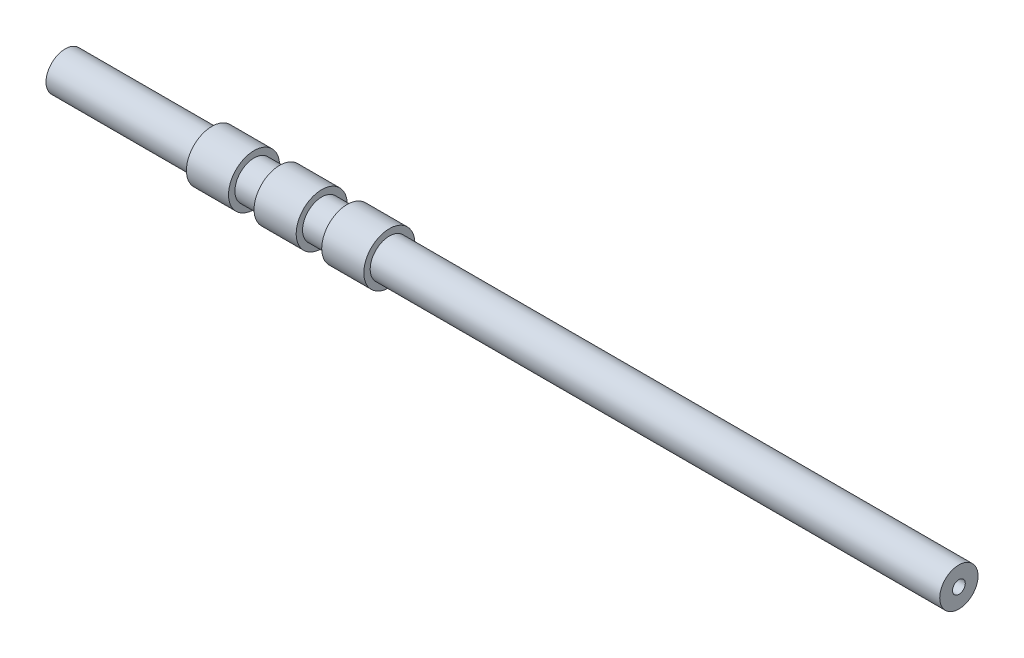
ISO-10303-21;
HEADER;
FILE_DESCRIPTION(('STEP AP214'),'2;1');
FILE_NAME('part.step','',(''),(''),'','','');
FILE_SCHEMA(('AUTOMOTIVE_DESIGN { 1 0 10303 214 1 1 1 1 }'));
ENDSEC;
DATA;
#1=APPLICATION_CONTEXT('core data for automotive mechanical design processes');
#2=APPLICATION_PROTOCOL_DEFINITION('international standard','automotive_design',2000,#1);
#3=PRODUCT_CONTEXT('',#1,'mechanical');
#4=PRODUCT('Part','Part','',(#3));
#5=PRODUCT_RELATED_PRODUCT_CATEGORY('part','',(#4));
#6=PRODUCT_DEFINITION_FORMATION('','',#4);
#7=PRODUCT_DEFINITION_CONTEXT('part definition',#1,'design');
#8=PRODUCT_DEFINITION('design','',#6,#7);
#9=PRODUCT_DEFINITION_SHAPE('','',#8);
#10=(LENGTH_UNIT() NAMED_UNIT(*) SI_UNIT(.MILLI.,.METRE.));
#11=(NAMED_UNIT(*) PLANE_ANGLE_UNIT() SI_UNIT($,.RADIAN.));
#12=(NAMED_UNIT(*) SI_UNIT($,.STERADIAN.) SOLID_ANGLE_UNIT());
#13=UNCERTAINTY_MEASURE_WITH_UNIT(LENGTH_MEASURE(1.E-05),#10,'distance_accuracy_value','');
#14=(GEOMETRIC_REPRESENTATION_CONTEXT(3) GLOBAL_UNCERTAINTY_ASSIGNED_CONTEXT((#13)) GLOBAL_UNIT_ASSIGNED_CONTEXT((#10,
#11,#12)) REPRESENTATION_CONTEXT('',''));
#15=CARTESIAN_POINT('',(0.,0.,0.));
#16=DIRECTION('',(0.,0.,1.));
#17=DIRECTION('',(1.,0.,0.));
#18=AXIS2_PLACEMENT_3D('',#15,#16,#17);
#19=CARTESIAN_POINT('',(-114.603174603175,0.,0.));
#20=DIRECTION('',(-1.,0.,0.));
#21=DIRECTION('',(0.,0.,1.));
#22=AXIS2_PLACEMENT_3D('',#19,#20,#21);
#23=CYLINDRICAL_SURFACE('',#22,5.);
#24=CARTESIAN_POINT('',(522.301587301587,0.,0.));
#25=DIRECTION('',(-1.,0.,0.));
#26=DIRECTION('',(0.,0.,1.));
#27=AXIS2_PLACEMENT_3D('',#24,#25,#26);
#28=CIRCLE('',#27,5.);
#29=CARTESIAN_POINT('',(522.301587301587,0.,5.));
#30=VERTEX_POINT('',#29);
#31=EDGE_CURVE('E123',#30,#30,#28,.T.);
#32=ORIENTED_EDGE('',*,*,#31,.F.);
#33=EDGE_LOOP('',(#32));
#34=FACE_BOUND('',#33,.T.);
#35=CARTESIAN_POINT('',(66.2115873015873,0.,0.));
#36=DIRECTION('',(-1.,0.,0.));
#37=DIRECTION('',(0.,0.,1.));
#38=AXIS2_PLACEMENT_3D('',#35,#36,#37);
#39=CIRCLE('',#38,5.);
#40=CARTESIAN_POINT('',(66.2115873015873,0.,5.));
#41=VERTEX_POINT('',#40);
#42=EDGE_CURVE('E10',#41,#41,#39,.T.);
#43=ORIENTED_EDGE('',*,*,#42,.T.);
#44=EDGE_LOOP('',(#43));
#45=FACE_BOUND('',#44,.T.);
#46=ADVANCED_FACE('F35',(#34,#45),#23,.F.);
#47=CARTESIAN_POINT('',(66.2115873015873,20.,0.));
#48=DIRECTION('',(1.,0.,0.));
#49=DIRECTION('',(0.,0.,-1.));
#50=AXIS2_PLACEMENT_3D('',#47,#48,#49);
#51=PLANE('',#50);
#52=ORIENTED_EDGE('',*,*,#42,.F.);
#53=EDGE_LOOP('',(#52));
#54=FACE_BOUND('',#53,.T.);
#55=CARTESIAN_POINT('',(66.2115873015873,0.,0.));
#56=DIRECTION('',(-1.,0.,0.));
#57=DIRECTION('',(0.,0.,1.));
#58=AXIS2_PLACEMENT_3D('',#55,#56,#57);
#59=CIRCLE('',#58,10.);
#60=CARTESIAN_POINT('',(66.2115873015873,0.,10.));
#61=VERTEX_POINT('',#60);
#62=EDGE_CURVE('E41',#61,#61,#59,.T.);
#63=ORIENTED_EDGE('',*,*,#62,.T.);
#64=EDGE_LOOP('',(#63));
#65=FACE_BOUND('',#64,.T.);
#66=ADVANCED_FACE('F131',(#54,#65),#51,.F.);
#67=CARTESIAN_POINT('',(-114.603174603175,0.,0.));
#68=DIRECTION('',(-1.,0.,0.));
#69=DIRECTION('',(0.,0.,1.));
#70=AXIS2_PLACEMENT_3D('',#67,#68,#69);
#71=CYLINDRICAL_SURFACE('',#70,10.);
#72=ORIENTED_EDGE('',*,*,#62,.F.);
#73=EDGE_LOOP('',(#72));
#74=FACE_BOUND('',#73,.T.);
#75=CARTESIAN_POINT('',(53.2415873015873,0.,0.));
#76=DIRECTION('',(-1.,0.,0.));
#77=DIRECTION('',(0.,0.,1.));
#78=AXIS2_PLACEMENT_3D('',#75,#76,#77);
#79=CIRCLE('',#78,10.);
#80=CARTESIAN_POINT('',(53.2415873015873,0.,10.));
#81=VERTEX_POINT('',#80);
#82=EDGE_CURVE('E45',#81,#81,#79,.T.);
#83=ORIENTED_EDGE('',*,*,#82,.T.);
#84=EDGE_LOOP('',(#83));
#85=FACE_BOUND('',#84,.T.);
#86=ADVANCED_FACE('F135',(#74,#85),#71,.F.);
#87=CARTESIAN_POINT('',(53.2415873015873,15.,0.));
#88=DIRECTION('',(-1.,0.,0.));
#89=DIRECTION('',(0.,0.,1.));
#90=AXIS2_PLACEMENT_3D('',#87,#88,#89);
#91=PLANE('',#90);
#92=ORIENTED_EDGE('',*,*,#82,.F.);
#93=EDGE_LOOP('',(#92));
#94=FACE_BOUND('',#93,.T.);
#95=CARTESIAN_POINT('',(53.2415873015873,0.,0.));
#96=DIRECTION('',(-1.,0.,0.));
#97=DIRECTION('',(0.,0.,1.));
#98=AXIS2_PLACEMENT_3D('',#95,#96,#97);
#99=CIRCLE('',#98,5.);
#100=CARTESIAN_POINT('',(53.2415873015873,0.,5.));
#101=VERTEX_POINT('',#100);
#102=EDGE_CURVE('E49',#101,#101,#99,.T.);
#103=ORIENTED_EDGE('',*,*,#102,.T.);
#104=EDGE_LOOP('',(#103));
#105=FACE_BOUND('',#104,.T.);
#106=ADVANCED_FACE('F140',(#94,#105),#91,.F.);
#107=CARTESIAN_POINT('',(-114.603174603175,0.,0.));
#108=DIRECTION('',(-1.,0.,0.));
#109=DIRECTION('',(0.,0.,1.));
#110=AXIS2_PLACEMENT_3D('',#107,#108,#109);
#111=CYLINDRICAL_SURFACE('',#110,5.);
#112=ORIENTED_EDGE('',*,*,#102,.F.);
#113=EDGE_LOOP('',(#112));
#114=FACE_BOUND('',#113,.T.);
#115=CARTESIAN_POINT('',(13.2415873015873,0.,0.));
#116=DIRECTION('',(-1.,0.,0.));
#117=DIRECTION('',(0.,0.,1.));
#118=AXIS2_PLACEMENT_3D('',#115,#116,#117);
#119=CIRCLE('',#118,5.);
#120=CARTESIAN_POINT('',(13.2415873015873,0.,5.));
#121=VERTEX_POINT('',#120);
#122=EDGE_CURVE('E54',#121,#121,#119,.T.);
#123=ORIENTED_EDGE('',*,*,#122,.T.);
#124=EDGE_LOOP('',(#123));
#125=FACE_BOUND('',#124,.T.);
#126=ADVANCED_FACE('F146',(#114,#125),#111,.F.);
#127=CARTESIAN_POINT('',(13.2415873015873,20.,0.));
#128=DIRECTION('',(1.,0.,0.));
#129=DIRECTION('',(0.,0.,-1.));
#130=AXIS2_PLACEMENT_3D('',#127,#128,#129);
#131=PLANE('',#130);
#132=ORIENTED_EDGE('',*,*,#122,.F.);
#133=EDGE_LOOP('',(#132));
#134=FACE_BOUND('',#133,.T.);
#135=CARTESIAN_POINT('',(13.2415873015873,0.,0.));
#136=DIRECTION('',(-1.,0.,0.));
#137=DIRECTION('',(0.,0.,1.));
#138=AXIS2_PLACEMENT_3D('',#135,#136,#137);
#139=CIRCLE('',#138,10.);
#140=CARTESIAN_POINT('',(13.2415873015873,0.,10.));
#141=VERTEX_POINT('',#140);
#142=EDGE_CURVE('E57',#141,#141,#139,.T.);
#143=ORIENTED_EDGE('',*,*,#142,.T.);
#144=EDGE_LOOP('',(#143));
#145=FACE_BOUND('',#144,.T.);
#146=ADVANCED_FACE('F150',(#134,#145),#131,.F.);
#147=CARTESIAN_POINT('',(-114.603174603175,0.,0.));
#148=DIRECTION('',(-1.,0.,0.));
#149=DIRECTION('',(0.,0.,1.));
#150=AXIS2_PLACEMENT_3D('',#147,#148,#149);
#151=CYLINDRICAL_SURFACE('',#150,10.);
#152=ORIENTED_EDGE('',*,*,#142,.F.);
#153=EDGE_LOOP('',(#152));
#154=FACE_BOUND('',#153,.T.);
#155=CARTESIAN_POINT('',(0.271587301587287,0.,0.));
#156=DIRECTION('',(-1.,0.,0.));
#157=DIRECTION('',(0.,0.,1.));
#158=AXIS2_PLACEMENT_3D('',#155,#156,#157);
#159=CIRCLE('',#158,10.);
#160=CARTESIAN_POINT('',(0.271587301587287,0.,10.));
#161=VERTEX_POINT('',#160);
#162=EDGE_CURVE('E60',#161,#161,#159,.T.);
#163=ORIENTED_EDGE('',*,*,#162,.T.);
#164=EDGE_LOOP('',(#163));
#165=FACE_BOUND('',#164,.T.);
#166=ADVANCED_FACE('F154',(#154,#165),#151,.F.);
#167=CARTESIAN_POINT('',(0.271587301587288,15.,0.));
#168=DIRECTION('',(-1.,0.,0.));
#169=DIRECTION('',(0.,0.,1.));
#170=AXIS2_PLACEMENT_3D('',#167,#168,#169);
#171=PLANE('',#170);
#172=ORIENTED_EDGE('',*,*,#162,.F.);
#173=EDGE_LOOP('',(#172));
#174=FACE_BOUND('',#173,.T.);
#175=CARTESIAN_POINT('',(0.271587301587287,0.,0.));
#176=DIRECTION('',(-1.,0.,0.));
#177=DIRECTION('',(0.,0.,1.));
#178=AXIS2_PLACEMENT_3D('',#175,#176,#177);
#179=CIRCLE('',#178,5.);
#180=CARTESIAN_POINT('',(0.271587301587287,0.,5.));
#181=VERTEX_POINT('',#180);
#182=EDGE_CURVE('E63',#181,#181,#179,.T.);
#183=ORIENTED_EDGE('',*,*,#182,.T.);
#184=EDGE_LOOP('',(#183));
#185=FACE_BOUND('',#184,.T.);
#186=ADVANCED_FACE('F158',(#174,#185),#171,.F.);
#187=CARTESIAN_POINT('',(-114.603174603175,0.,0.));
#188=DIRECTION('',(-1.,0.,0.));
#189=DIRECTION('',(0.,0.,1.));
#190=AXIS2_PLACEMENT_3D('',#187,#188,#189);
#191=CYLINDRICAL_SURFACE('',#190,5.);
#192=ORIENTED_EDGE('',*,*,#182,.F.);
#193=EDGE_LOOP('',(#192));
#194=FACE_BOUND('',#193,.T.);
#195=CARTESIAN_POINT('',(-39.7284126984127,0.,0.));
#196=DIRECTION('',(-1.,0.,0.));
#197=DIRECTION('',(0.,0.,1.));
#198=AXIS2_PLACEMENT_3D('',#195,#196,#197);
#199=CIRCLE('',#198,5.);
#200=CARTESIAN_POINT('',(-39.7284126984127,0.,5.));
#201=VERTEX_POINT('',#200);
#202=EDGE_CURVE('E66',#201,#201,#199,.T.);
#203=ORIENTED_EDGE('',*,*,#202,.T.);
#204=EDGE_LOOP('',(#203));
#205=FACE_BOUND('',#204,.T.);
#206=ADVANCED_FACE('F162',(#194,#205),#191,.F.);
#207=CARTESIAN_POINT('',(-39.7284126984127,20.,0.));
#208=DIRECTION('',(1.,0.,0.));
#209=DIRECTION('',(0.,0.,-1.));
#210=AXIS2_PLACEMENT_3D('',#207,#208,#209);
#211=PLANE('',#210);
#212=ORIENTED_EDGE('',*,*,#202,.F.);
#213=EDGE_LOOP('',(#212));
#214=FACE_BOUND('',#213,.T.);
#215=CARTESIAN_POINT('',(-39.7284126984127,0.,0.));
#216=DIRECTION('',(-1.,0.,0.));
#217=DIRECTION('',(0.,0.,1.));
#218=AXIS2_PLACEMENT_3D('',#215,#216,#217);
#219=CIRCLE('',#218,10.);
#220=CARTESIAN_POINT('',(-39.7284126984127,0.,10.));
#221=VERTEX_POINT('',#220);
#222=EDGE_CURVE('E69',#221,#221,#219,.T.);
#223=ORIENTED_EDGE('',*,*,#222,.T.);
#224=EDGE_LOOP('',(#223));
#225=FACE_BOUND('',#224,.T.);
#226=ADVANCED_FACE('F166',(#214,#225),#211,.F.);
#227=CARTESIAN_POINT('',(-114.603174603175,0.,0.));
#228=DIRECTION('',(-1.,0.,0.));
#229=DIRECTION('',(0.,0.,1.));
#230=AXIS2_PLACEMENT_3D('',#227,#228,#229);
#231=CYLINDRICAL_SURFACE('',#230,10.);
#232=ORIENTED_EDGE('',*,*,#222,.F.);
#233=EDGE_LOOP('',(#232));
#234=FACE_BOUND('',#233,.T.);
#235=CARTESIAN_POINT('',(-52.6984126984127,0.,0.));
#236=DIRECTION('',(-1.,0.,0.));
#237=DIRECTION('',(0.,0.,1.));
#238=AXIS2_PLACEMENT_3D('',#235,#236,#237);
#239=CIRCLE('',#238,10.);
#240=CARTESIAN_POINT('',(-52.6984126984127,0.,10.));
#241=VERTEX_POINT('',#240);
#242=EDGE_CURVE('E72',#241,#241,#239,.T.);
#243=ORIENTED_EDGE('',*,*,#242,.T.);
#244=EDGE_LOOP('',(#243));
#245=FACE_BOUND('',#244,.T.);
#246=ADVANCED_FACE('F170',(#234,#245),#231,.F.);
#247=CARTESIAN_POINT('',(-52.6984126984127,15.,0.));
#248=DIRECTION('',(-1.,0.,0.));
#249=DIRECTION('',(0.,0.,1.));
#250=AXIS2_PLACEMENT_3D('',#247,#248,#249);
#251=PLANE('',#250);
#252=ORIENTED_EDGE('',*,*,#242,.F.);
#253=EDGE_LOOP('',(#252));
#254=FACE_BOUND('',#253,.T.);
#255=CARTESIAN_POINT('',(-52.6984126984127,0.,0.));
#256=DIRECTION('',(-1.,0.,0.));
#257=DIRECTION('',(0.,0.,1.));
#258=AXIS2_PLACEMENT_3D('',#255,#256,#257);
#259=CIRCLE('',#258,5.);
#260=CARTESIAN_POINT('',(-52.6984126984127,0.,5.));
#261=VERTEX_POINT('',#260);
#262=EDGE_CURVE('E75',#261,#261,#259,.T.);
#263=ORIENTED_EDGE('',*,*,#262,.T.);
#264=EDGE_LOOP('',(#263));
#265=FACE_BOUND('',#264,.T.);
#266=ADVANCED_FACE('F174',(#254,#265),#251,.F.);
#267=CARTESIAN_POINT('',(-114.603174603175,0.,0.));
#268=DIRECTION('',(-1.,0.,0.));
#269=DIRECTION('',(0.,0.,1.));
#270=AXIS2_PLACEMENT_3D('',#267,#268,#269);
#271=CYLINDRICAL_SURFACE('',#270,4.99999999999999);
#272=ORIENTED_EDGE('',*,*,#262,.F.);
#273=EDGE_LOOP('',(#272));
#274=FACE_BOUND('',#273,.T.);
#275=CARTESIAN_POINT('',(-177.698412698413,0.,0.));
#276=DIRECTION('',(-1.,0.,0.));
#277=DIRECTION('',(0.,0.,1.));
#278=AXIS2_PLACEMENT_3D('',#275,#276,#277);
#279=CIRCLE('',#278,4.99999999999999);
#280=CARTESIAN_POINT('',(-177.698412698413,0.,4.99999999999999));
#281=VERTEX_POINT('',#280);
#282=EDGE_CURVE('E78',#281,#281,#279,.T.);
#283=ORIENTED_EDGE('',*,*,#282,.T.);
#284=EDGE_LOOP('',(#283));
#285=FACE_BOUND('',#284,.T.);
#286=ADVANCED_FACE('F178',(#274,#285),#271,.F.);
#287=CARTESIAN_POINT('',(-177.698412698413,4.99999999999999,0.));
#288=DIRECTION('',(-1.,0.,0.));
#289=DIRECTION('',(0.,0.,1.));
#290=AXIS2_PLACEMENT_3D('',#287,#288,#289);
#291=PLANE('',#290);
#292=CARTESIAN_POINT('',(-177.698412698413,0.,0.));
#293=DIRECTION('',(-1.,0.,0.));
#294=DIRECTION('',(0.,0.,1.));
#295=AXIS2_PLACEMENT_3D('',#292,#293,#294);
#296=CIRCLE('',#295,15.);
#297=CARTESIAN_POINT('',(-177.698412698413,0.,15.));
#298=VERTEX_POINT('',#297);
#299=EDGE_CURVE('E81',#298,#298,#296,.T.);
#300=ORIENTED_EDGE('',*,*,#299,.T.);
#301=EDGE_LOOP('',(#300));
#302=FACE_BOUND('',#301,.T.);
#303=ORIENTED_EDGE('',*,*,#282,.F.);
#304=EDGE_LOOP('',(#303));
#305=FACE_BOUND('',#304,.T.);
#306=ADVANCED_FACE('F182',(#302,#305),#291,.T.);
#307=CARTESIAN_POINT('',(-114.603174603175,0.,0.));
#308=DIRECTION('',(-1.,0.,0.));
#309=DIRECTION('',(0.,0.,1.));
#310=AXIS2_PLACEMENT_3D('',#307,#308,#309);
#311=CYLINDRICAL_SURFACE('',#310,15.);
#312=CARTESIAN_POINT('',(-62.6984126984127,0.,0.));
#313=DIRECTION('',(-1.,0.,0.));
#314=DIRECTION('',(0.,0.,1.));
#315=AXIS2_PLACEMENT_3D('',#312,#313,#314);
#316=CIRCLE('',#315,15.);
#317=CARTESIAN_POINT('',(-62.6984126984127,0.,15.));
#318=VERTEX_POINT('',#317);
#319=EDGE_CURVE('E84',#318,#318,#316,.T.);
#320=ORIENTED_EDGE('',*,*,#319,.T.);
#321=EDGE_LOOP('',(#320));
#322=FACE_BOUND('',#321,.T.);
#323=ORIENTED_EDGE('',*,*,#299,.F.);
#324=EDGE_LOOP('',(#323));
#325=FACE_BOUND('',#324,.T.);
#326=ADVANCED_FACE('F186',(#322,#325),#311,.T.);
#327=CARTESIAN_POINT('',(-62.6984126984127,15.,0.));
#328=DIRECTION('',(-1.,0.,0.));
#329=DIRECTION('',(0.,0.,1.));
#330=AXIS2_PLACEMENT_3D('',#327,#328,#329);
#331=PLANE('',#330);
#332=CARTESIAN_POINT('',(-62.6984126984127,0.,0.));
#333=DIRECTION('',(-1.,0.,0.));
#334=DIRECTION('',(0.,0.,1.));
#335=AXIS2_PLACEMENT_3D('',#332,#333,#334);
#336=CIRCLE('',#335,20.);
#337=CARTESIAN_POINT('',(-62.6984126984127,0.,20.));
#338=VERTEX_POINT('',#337);
#339=EDGE_CURVE('E87',#338,#338,#336,.T.);
#340=ORIENTED_EDGE('',*,*,#339,.T.);
#341=EDGE_LOOP('',(#340));
#342=FACE_BOUND('',#341,.T.);
#343=ORIENTED_EDGE('',*,*,#319,.F.);
#344=EDGE_LOOP('',(#343));
#345=FACE_BOUND('',#344,.T.);
#346=ADVANCED_FACE('F190',(#342,#345),#331,.T.);
#347=CARTESIAN_POINT('',(-114.603174603175,0.,0.));
#348=DIRECTION('',(-1.,0.,0.));
#349=DIRECTION('',(0.,0.,1.));
#350=AXIS2_PLACEMENT_3D('',#347,#348,#349);
#351=CYLINDRICAL_SURFACE('',#350,20.);
#352=CARTESIAN_POINT('',(-29.7284126984127,0.,0.));
#353=DIRECTION('',(-1.,0.,0.));
#354=DIRECTION('',(0.,0.,1.));
#355=AXIS2_PLACEMENT_3D('',#352,#353,#354);
#356=CIRCLE('',#355,20.);
#357=CARTESIAN_POINT('',(-29.7284126984127,0.,20.));
#358=VERTEX_POINT('',#357);
#359=EDGE_CURVE('E90',#358,#358,#356,.T.);
#360=ORIENTED_EDGE('',*,*,#359,.T.);
#361=EDGE_LOOP('',(#360));
#362=FACE_BOUND('',#361,.T.);
#363=ORIENTED_EDGE('',*,*,#339,.F.);
#364=EDGE_LOOP('',(#363));
#365=FACE_BOUND('',#364,.T.);
#366=ADVANCED_FACE('F194',(#362,#365),#351,.T.);
#367=CARTESIAN_POINT('',(-29.7284126984127,20.,0.));
#368=DIRECTION('',(1.,0.,0.));
#369=DIRECTION('',(0.,0.,-1.));
#370=AXIS2_PLACEMENT_3D('',#367,#368,#369);
#371=PLANE('',#370);
#372=CARTESIAN_POINT('',(-29.7284126984127,0.,0.));
#373=DIRECTION('',(-1.,0.,0.));
#374=DIRECTION('',(0.,0.,1.));
#375=AXIS2_PLACEMENT_3D('',#372,#373,#374);
#376=CIRCLE('',#375,15.);
#377=CARTESIAN_POINT('',(-29.7284126984127,0.,15.));
#378=VERTEX_POINT('',#377);
#379=EDGE_CURVE('E93',#378,#378,#376,.T.);
#380=ORIENTED_EDGE('',*,*,#379,.T.);
#381=EDGE_LOOP('',(#380));
#382=FACE_BOUND('',#381,.T.);
#383=ORIENTED_EDGE('',*,*,#359,.F.);
#384=EDGE_LOOP('',(#383));
#385=FACE_BOUND('',#384,.T.);
#386=ADVANCED_FACE('F198',(#382,#385),#371,.T.);
#387=CARTESIAN_POINT('',(-114.603174603175,0.,0.));
#388=DIRECTION('',(-1.,0.,0.));
#389=DIRECTION('',(0.,0.,1.));
#390=AXIS2_PLACEMENT_3D('',#387,#388,#389);
#391=CYLINDRICAL_SURFACE('',#390,15.);
#392=CARTESIAN_POINT('',(-9.72841269841271,0.,0.));
#393=DIRECTION('',(-1.,0.,0.));
#394=DIRECTION('',(0.,0.,1.));
#395=AXIS2_PLACEMENT_3D('',#392,#393,#394);
#396=CIRCLE('',#395,15.);
#397=CARTESIAN_POINT('',(-9.72841269841271,0.,15.));
#398=VERTEX_POINT('',#397);
#399=EDGE_CURVE('E96',#398,#398,#396,.T.);
#400=ORIENTED_EDGE('',*,*,#399,.T.);
#401=EDGE_LOOP('',(#400));
#402=FACE_BOUND('',#401,.T.);
#403=ORIENTED_EDGE('',*,*,#379,.F.);
#404=EDGE_LOOP('',(#403));
#405=FACE_BOUND('',#404,.T.);
#406=ADVANCED_FACE('F202',(#402,#405),#391,.T.);
#407=CARTESIAN_POINT('',(-9.72841269841271,15.,0.));
#408=DIRECTION('',(-1.,0.,0.));
#409=DIRECTION('',(0.,0.,1.));
#410=AXIS2_PLACEMENT_3D('',#407,#408,#409);
#411=PLANE('',#410);
#412=CARTESIAN_POINT('',(-9.72841269841271,0.,0.));
#413=DIRECTION('',(-1.,0.,0.));
#414=DIRECTION('',(0.,0.,1.));
#415=AXIS2_PLACEMENT_3D('',#412,#413,#414);
#416=CIRCLE('',#415,20.);
#417=CARTESIAN_POINT('',(-9.72841269841271,0.,20.));
#418=VERTEX_POINT('',#417);
#419=EDGE_CURVE('E99',#418,#418,#416,.T.);
#420=ORIENTED_EDGE('',*,*,#419,.T.);
#421=EDGE_LOOP('',(#420));
#422=FACE_BOUND('',#421,.T.);
#423=ORIENTED_EDGE('',*,*,#399,.F.);
#424=EDGE_LOOP('',(#423));
#425=FACE_BOUND('',#424,.T.);
#426=ADVANCED_FACE('F206',(#422,#425),#411,.T.);
#427=CARTESIAN_POINT('',(-114.603174603175,0.,0.));
#428=DIRECTION('',(-1.,0.,0.));
#429=DIRECTION('',(0.,0.,1.));
#430=AXIS2_PLACEMENT_3D('',#427,#428,#429);
#431=CYLINDRICAL_SURFACE('',#430,20.);
#432=CARTESIAN_POINT('',(23.2415873015873,0.,0.));
#433=DIRECTION('',(-1.,0.,0.));
#434=DIRECTION('',(0.,0.,1.));
#435=AXIS2_PLACEMENT_3D('',#432,#433,#434);
#436=CIRCLE('',#435,20.);
#437=CARTESIAN_POINT('',(23.2415873015873,0.,20.));
#438=VERTEX_POINT('',#437);
#439=EDGE_CURVE('E102',#438,#438,#436,.T.);
#440=ORIENTED_EDGE('',*,*,#439,.T.);
#441=EDGE_LOOP('',(#440));
#442=FACE_BOUND('',#441,.T.);
#443=ORIENTED_EDGE('',*,*,#419,.F.);
#444=EDGE_LOOP('',(#443));
#445=FACE_BOUND('',#444,.T.);
#446=ADVANCED_FACE('F210',(#442,#445),#431,.T.);
#447=CARTESIAN_POINT('',(23.2415873015873,20.,0.));
#448=DIRECTION('',(1.,0.,0.));
#449=DIRECTION('',(0.,0.,-1.));
#450=AXIS2_PLACEMENT_3D('',#447,#448,#449);
#451=PLANE('',#450);
#452=CARTESIAN_POINT('',(23.2415873015873,0.,0.));
#453=DIRECTION('',(-1.,0.,0.));
#454=DIRECTION('',(0.,0.,1.));
#455=AXIS2_PLACEMENT_3D('',#452,#453,#454);
#456=CIRCLE('',#455,15.);
#457=CARTESIAN_POINT('',(23.2415873015873,0.,15.));
#458=VERTEX_POINT('',#457);
#459=EDGE_CURVE('E105',#458,#458,#456,.T.);
#460=ORIENTED_EDGE('',*,*,#459,.T.);
#461=EDGE_LOOP('',(#460));
#462=FACE_BOUND('',#461,.T.);
#463=ORIENTED_EDGE('',*,*,#439,.F.);
#464=EDGE_LOOP('',(#463));
#465=FACE_BOUND('',#464,.T.);
#466=ADVANCED_FACE('F214',(#462,#465),#451,.T.);
#467=CARTESIAN_POINT('',(-114.603174603175,0.,0.));
#468=DIRECTION('',(-1.,0.,0.));
#469=DIRECTION('',(0.,0.,1.));
#470=AXIS2_PLACEMENT_3D('',#467,#468,#469);
#471=CYLINDRICAL_SURFACE('',#470,15.);
#472=CARTESIAN_POINT('',(43.2415873015873,0.,0.));
#473=DIRECTION('',(-1.,0.,0.));
#474=DIRECTION('',(0.,0.,1.));
#475=AXIS2_PLACEMENT_3D('',#472,#473,#474);
#476=CIRCLE('',#475,15.);
#477=CARTESIAN_POINT('',(43.2415873015873,0.,15.));
#478=VERTEX_POINT('',#477);
#479=EDGE_CURVE('E108',#478,#478,#476,.T.);
#480=ORIENTED_EDGE('',*,*,#479,.T.);
#481=EDGE_LOOP('',(#480));
#482=FACE_BOUND('',#481,.T.);
#483=ORIENTED_EDGE('',*,*,#459,.F.);
#484=EDGE_LOOP('',(#483));
#485=FACE_BOUND('',#484,.T.);
#486=ADVANCED_FACE('F218',(#482,#485),#471,.T.);
#487=CARTESIAN_POINT('',(43.2415873015873,15.,0.));
#488=DIRECTION('',(-1.,0.,0.));
#489=DIRECTION('',(0.,0.,1.));
#490=AXIS2_PLACEMENT_3D('',#487,#488,#489);
#491=PLANE('',#490);
#492=CARTESIAN_POINT('',(43.2415873015873,0.,0.));
#493=DIRECTION('',(-1.,0.,0.));
#494=DIRECTION('',(0.,0.,1.));
#495=AXIS2_PLACEMENT_3D('',#492,#493,#494);
#496=CIRCLE('',#495,20.);
#497=CARTESIAN_POINT('',(43.2415873015873,0.,20.));
#498=VERTEX_POINT('',#497);
#499=EDGE_CURVE('E111',#498,#498,#496,.T.);
#500=ORIENTED_EDGE('',*,*,#499,.T.);
#501=EDGE_LOOP('',(#500));
#502=FACE_BOUND('',#501,.T.);
#503=ORIENTED_EDGE('',*,*,#479,.F.);
#504=EDGE_LOOP('',(#503));
#505=FACE_BOUND('',#504,.T.);
#506=ADVANCED_FACE('F222',(#502,#505),#491,.T.);
#507=CARTESIAN_POINT('',(-114.603174603175,0.,0.));
#508=DIRECTION('',(-1.,0.,0.));
#509=DIRECTION('',(0.,0.,1.));
#510=AXIS2_PLACEMENT_3D('',#507,#508,#509);
#511=CYLINDRICAL_SURFACE('',#510,20.);
#512=CARTESIAN_POINT('',(76.2115873015873,0.,0.));
#513=DIRECTION('',(-1.,0.,0.));
#514=DIRECTION('',(0.,0.,1.));
#515=AXIS2_PLACEMENT_3D('',#512,#513,#514);
#516=CIRCLE('',#515,20.);
#517=CARTESIAN_POINT('',(76.2115873015873,0.,20.));
#518=VERTEX_POINT('',#517);
#519=EDGE_CURVE('E114',#518,#518,#516,.T.);
#520=ORIENTED_EDGE('',*,*,#519,.T.);
#521=EDGE_LOOP('',(#520));
#522=FACE_BOUND('',#521,.T.);
#523=ORIENTED_EDGE('',*,*,#499,.F.);
#524=EDGE_LOOP('',(#523));
#525=FACE_BOUND('',#524,.T.);
#526=ADVANCED_FACE('F226',(#522,#525),#511,.T.);
#527=CARTESIAN_POINT('',(76.2115873015873,20.,0.));
#528=DIRECTION('',(1.,0.,0.));
#529=DIRECTION('',(0.,0.,-1.));
#530=AXIS2_PLACEMENT_3D('',#527,#528,#529);
#531=PLANE('',#530);
#532=CARTESIAN_POINT('',(76.2115873015873,0.,0.));
#533=DIRECTION('',(-1.,0.,0.));
#534=DIRECTION('',(0.,0.,1.));
#535=AXIS2_PLACEMENT_3D('',#532,#533,#534);
#536=CIRCLE('',#535,15.);
#537=CARTESIAN_POINT('',(76.2115873015873,0.,15.));
#538=VERTEX_POINT('',#537);
#539=EDGE_CURVE('E117',#538,#538,#536,.T.);
#540=ORIENTED_EDGE('',*,*,#539,.T.);
#541=EDGE_LOOP('',(#540));
#542=FACE_BOUND('',#541,.T.);
#543=ORIENTED_EDGE('',*,*,#519,.F.);
#544=EDGE_LOOP('',(#543));
#545=FACE_BOUND('',#544,.T.);
#546=ADVANCED_FACE('F230',(#542,#545),#531,.T.);
#547=CARTESIAN_POINT('',(-114.603174603175,0.,0.));
#548=DIRECTION('',(-1.,0.,0.));
#549=DIRECTION('',(0.,0.,1.));
#550=AXIS2_PLACEMENT_3D('',#547,#548,#549);
#551=CYLINDRICAL_SURFACE('',#550,15.);
#552=CARTESIAN_POINT('',(522.301587301587,0.,0.));
#553=DIRECTION('',(-1.,0.,0.));
#554=DIRECTION('',(0.,0.,1.));
#555=AXIS2_PLACEMENT_3D('',#552,#553,#554);
#556=CIRCLE('',#555,15.);
#557=CARTESIAN_POINT('',(522.301587301587,0.,15.));
#558=VERTEX_POINT('',#557);
#559=EDGE_CURVE('E120',#558,#558,#556,.T.);
#560=ORIENTED_EDGE('',*,*,#559,.T.);
#561=EDGE_LOOP('',(#560));
#562=FACE_BOUND('',#561,.T.);
#563=ORIENTED_EDGE('',*,*,#539,.F.);
#564=EDGE_LOOP('',(#563));
#565=FACE_BOUND('',#564,.T.);
#566=ADVANCED_FACE('F234',(#562,#565),#551,.T.);
#567=CARTESIAN_POINT('',(522.301587301587,15.,0.));
#568=DIRECTION('',(1.,0.,0.));
#569=DIRECTION('',(0.,0.,-1.));
#570=AXIS2_PLACEMENT_3D('',#567,#568,#569);
#571=PLANE('',#570);
#572=ORIENTED_EDGE('',*,*,#31,.T.);
#573=EDGE_LOOP('',(#572));
#574=FACE_BOUND('',#573,.T.);
#575=ORIENTED_EDGE('',*,*,#559,.F.);
#576=EDGE_LOOP('',(#575));
#577=FACE_BOUND('',#576,.T.);
#578=ADVANCED_FACE('F127',(#574,#577),#571,.T.);
#579=CLOSED_SHELL('',(#46,#66,#86,#106,#126,#146,#166,#186,#206,#226,#246,#266,#286,#306,#326,
#346,#366,#386,#406,#426,#446,#466,#486,#506,#526,#546,#566,#578));
#580=MANIFOLD_SOLID_BREP('B2',#579);
#581=ADVANCED_BREP_SHAPE_REPRESENTATION('',(#18,#580),#14);
#582=SHAPE_DEFINITION_REPRESENTATION(#9,#581);
ENDSEC;
END-ISO-10303-21;
